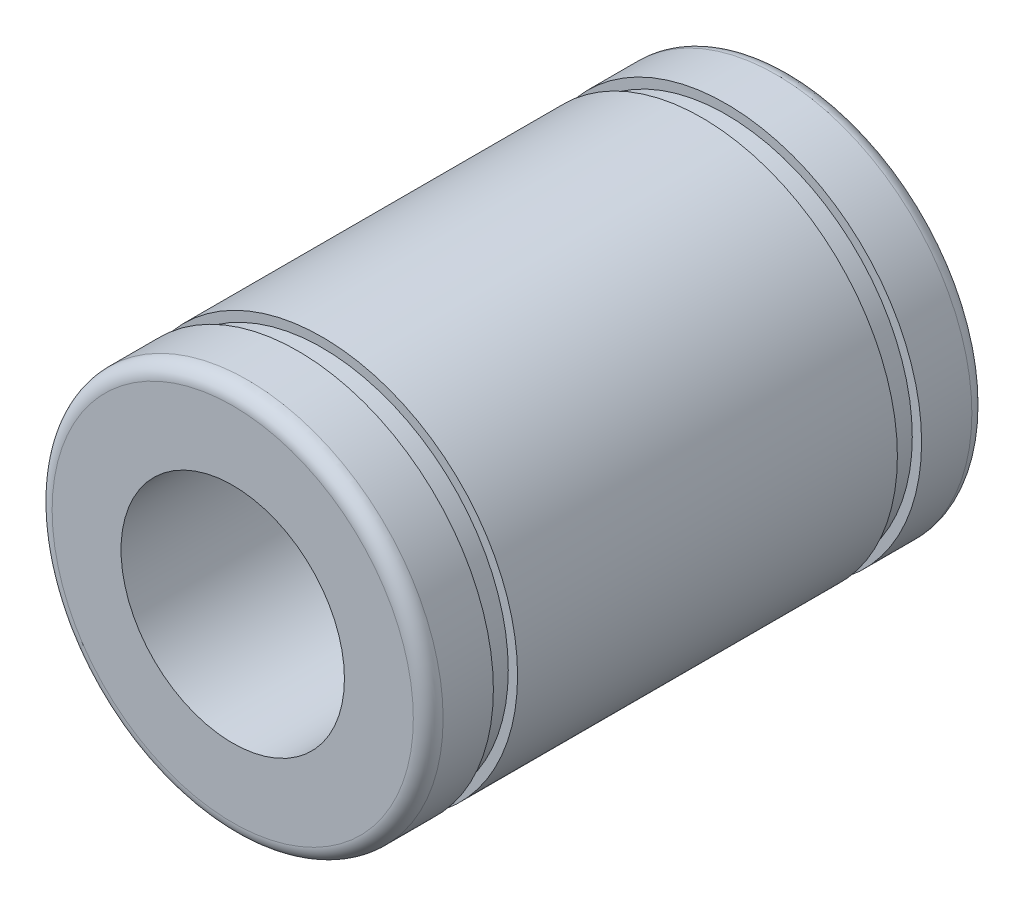
ISO-10303-21;
HEADER;
FILE_DESCRIPTION(('STEP AP214'),'2;1');
FILE_NAME('part.step','',(''),(''),'','','');
FILE_SCHEMA(('AUTOMOTIVE_DESIGN { 1 0 10303 214 1 1 1 1 }'));
ENDSEC;
DATA;
#1=APPLICATION_CONTEXT('core data for automotive mechanical design processes');
#2=APPLICATION_PROTOCOL_DEFINITION('international standard','automotive_design',2000,#1);
#3=PRODUCT_CONTEXT('',#1,'mechanical');
#4=PRODUCT('Part','Part','',(#3));
#5=PRODUCT_RELATED_PRODUCT_CATEGORY('part','',(#4));
#6=PRODUCT_DEFINITION_FORMATION('','',#4);
#7=PRODUCT_DEFINITION_CONTEXT('part definition',#1,'design');
#8=PRODUCT_DEFINITION('design','',#6,#7);
#9=PRODUCT_DEFINITION_SHAPE('','',#8);
#10=(LENGTH_UNIT() NAMED_UNIT(*) SI_UNIT(.MILLI.,.METRE.));
#11=(NAMED_UNIT(*) PLANE_ANGLE_UNIT() SI_UNIT($,.RADIAN.));
#12=(NAMED_UNIT(*) SI_UNIT($,.STERADIAN.) SOLID_ANGLE_UNIT());
#13=UNCERTAINTY_MEASURE_WITH_UNIT(LENGTH_MEASURE(1.E-05),#10,'distance_accuracy_value','');
#14=(GEOMETRIC_REPRESENTATION_CONTEXT(3) GLOBAL_UNCERTAINTY_ASSIGNED_CONTEXT((#13)) GLOBAL_UNIT_ASSIGNED_CONTEXT((#10,
#11,#12)) REPRESENTATION_CONTEXT('',''));
#15=CARTESIAN_POINT('',(0.,0.,0.));
#16=DIRECTION('',(0.,0.,1.));
#17=DIRECTION('',(1.,0.,0.));
#18=AXIS2_PLACEMENT_3D('',#15,#16,#17);
#19=CARTESIAN_POINT('',(0.,0.,-16.85));
#20=DIRECTION('',(0.,0.,1.));
#21=DIRECTION('',(1.,0.,0.));
#22=AXIS2_PLACEMENT_3D('',#19,#20,#21);
#23=CYLINDRICAL_SURFACE('',#22,6.);
#24=CARTESIAN_POINT('',(0.,0.,-1.85));
#25=DIRECTION('',(0.,0.,1.));
#26=DIRECTION('',(1.,0.,0.));
#27=AXIS2_PLACEMENT_3D('',#24,#25,#26);
#28=CIRCLE('',#27,6.);
#29=CARTESIAN_POINT('',(6.,0.,-1.85));
#30=VERTEX_POINT('',#29);
#31=EDGE_CURVE('E177',#30,#30,#28,.F.);
#32=ORIENTED_EDGE('',*,*,#31,.F.);
#33=EDGE_LOOP('',(#32));
#34=FACE_BOUND('',#33,.T.);
#35=CARTESIAN_POINT('',(0.,0.,-31.85));
#36=DIRECTION('',(0.,0.,1.));
#37=DIRECTION('',(1.,0.,0.));
#38=AXIS2_PLACEMENT_3D('',#35,#36,#37);
#39=CIRCLE('',#38,6.);
#40=CARTESIAN_POINT('',(6.,0.,-31.85));
#41=VERTEX_POINT('',#40);
#42=EDGE_CURVE('E62',#41,#41,#39,.T.);
#43=ORIENTED_EDGE('',*,*,#42,.F.);
#44=EDGE_LOOP('',(#43));
#45=FACE_BOUND('',#44,.T.);
#46=ADVANCED_FACE('F16',(#34,#45),#23,.F.);
#47=CARTESIAN_POINT('',(0.,7.85,-1.85));
#48=DIRECTION('',(0.,0.,1.));
#49=DIRECTION('',(1.,0.,0.));
#50=AXIS2_PLACEMENT_3D('',#47,#48,#49);
#51=PLANE('',#50);
#52=ORIENTED_EDGE('',*,*,#31,.T.);
#53=EDGE_LOOP('',(#52));
#54=FACE_BOUND('',#53,.T.);
#55=CARTESIAN_POINT('',(0.,0.,-1.85000000000001));
#56=DIRECTION('',(0.,0.,-1.));
#57=DIRECTION('',(-1.,0.,0.));
#58=AXIS2_PLACEMENT_3D('',#55,#56,#57);
#59=CIRCLE('',#58,9.7);
#60=CARTESIAN_POINT('',(-9.7,0.,-1.85));
#61=VERTEX_POINT('',#60);
#62=CARTESIAN_POINT('',(0.,9.7,-1.85));
#63=VERTEX_POINT('',#62);
#64=EDGE_CURVE('E56',#61,#63,#59,.T.);
#65=ORIENTED_EDGE('',*,*,#64,.F.);
#66=CARTESIAN_POINT('',(0.,0.,-1.85000000000001));
#67=DIRECTION('',(0.,0.,-1.));
#68=DIRECTION('',(1.,0.,0.));
#69=AXIS2_PLACEMENT_3D('',#66,#67,#68);
#70=CIRCLE('',#69,9.7);
#71=CARTESIAN_POINT('',(9.7,0.,-1.85));
#72=VERTEX_POINT('',#71);
#73=EDGE_CURVE('E52',#72,#61,#70,.T.);
#74=ORIENTED_EDGE('',*,*,#73,.F.);
#75=CARTESIAN_POINT('',(0.,0.,-1.85000000000001));
#76=DIRECTION('',(0.,0.,-1.));
#77=DIRECTION('',(0.,1.,0.));
#78=AXIS2_PLACEMENT_3D('',#75,#76,#77);
#79=CIRCLE('',#78,9.7);
#80=EDGE_CURVE('E58',#63,#72,#79,.T.);
#81=ORIENTED_EDGE('',*,*,#80,.F.);
#82=EDGE_LOOP('',(#65,#74,#81));
#83=FACE_BOUND('',#82,.T.);
#84=ADVANCED_FACE('F65',(#54,#83),#51,.T.);
#85=CARTESIAN_POINT('',(0.,7.85,-31.85));
#86=DIRECTION('',(0.,0.,-1.));
#87=DIRECTION('',(-1.,0.,0.));
#88=AXIS2_PLACEMENT_3D('',#85,#86,#87);
#89=PLANE('',#88);
#90=CARTESIAN_POINT('',(0.,0.,-31.85));
#91=DIRECTION('',(0.,0.,1.));
#92=DIRECTION('',(-1.,0.,0.));
#93=AXIS2_PLACEMENT_3D('',#90,#91,#92);
#94=CIRCLE('',#93,9.7);
#95=CARTESIAN_POINT('',(-9.7,0.,-31.85));
#96=VERTEX_POINT('',#95);
#97=CARTESIAN_POINT('',(9.7,0.,-31.85));
#98=VERTEX_POINT('',#97);
#99=EDGE_CURVE('E120',#96,#98,#94,.T.);
#100=ORIENTED_EDGE('',*,*,#99,.F.);
#101=CARTESIAN_POINT('',(0.,0.,-31.85));
#102=DIRECTION('',(0.,0.,1.));
#103=DIRECTION('',(0.,1.,0.));
#104=AXIS2_PLACEMENT_3D('',#101,#102,#103);
#105=CIRCLE('',#104,9.7);
#106=CARTESIAN_POINT('',(0.,9.7,-31.85));
#107=VERTEX_POINT('',#106);
#108=EDGE_CURVE('E140',#107,#96,#105,.T.);
#109=ORIENTED_EDGE('',*,*,#108,.F.);
#110=CARTESIAN_POINT('',(0.,0.,-31.85));
#111=DIRECTION('',(0.,0.,1.));
#112=DIRECTION('',(1.,0.,0.));
#113=AXIS2_PLACEMENT_3D('',#110,#111,#112);
#114=CIRCLE('',#113,9.7);
#115=EDGE_CURVE('E36',#98,#107,#114,.T.);
#116=ORIENTED_EDGE('',*,*,#115,.F.);
#117=EDGE_LOOP('',(#100,#109,#116));
#118=FACE_BOUND('',#117,.T.);
#119=ORIENTED_EDGE('',*,*,#42,.T.);
#120=EDGE_LOOP('',(#119));
#121=FACE_BOUND('',#120,.T.);
#122=ADVANCED_FACE('F82',(#118,#121),#89,.T.);
#123=CARTESIAN_POINT('',(0.,0.,-2.65000000000001));
#124=DIRECTION('',(0.,0.,-1.));
#125=DIRECTION('',(-1.,0.,0.));
#126=AXIS2_PLACEMENT_3D('',#123,#124,#125);
#127=TOROIDAL_SURFACE('',#126,9.7,0.800000000000004);
#128=ORIENTED_EDGE('',*,*,#73,.T.);
#129=ORIENTED_EDGE('',*,*,#64,.T.);
#130=ORIENTED_EDGE('',*,*,#80,.T.);
#131=EDGE_LOOP('',(#128,#129,#130));
#132=FACE_BOUND('',#131,.T.);
#133=CARTESIAN_POINT('',(0.,0.,-2.65));
#134=DIRECTION('',(0.,0.,1.));
#135=DIRECTION('',(1.,0.,0.));
#136=AXIS2_PLACEMENT_3D('',#133,#134,#135);
#137=CIRCLE('',#136,10.5);
#138=CARTESIAN_POINT('',(10.5,0.,-2.65));
#139=VERTEX_POINT('',#138);
#140=EDGE_CURVE('E117',#139,#139,#137,.F.);
#141=ORIENTED_EDGE('',*,*,#140,.F.);
#142=EDGE_LOOP('',(#141));
#143=FACE_BOUND('',#142,.T.);
#144=ADVANCED_FACE('F54',(#132,#143),#127,.T.);
#145=CARTESIAN_POINT('',(0.,0.,-31.05));
#146=DIRECTION('',(0.,0.,-1.));
#147=DIRECTION('',(-1.,0.,0.));
#148=AXIS2_PLACEMENT_3D('',#145,#146,#147);
#149=TOROIDAL_SURFACE('',#148,9.7,0.799999999999999);
#150=ORIENTED_EDGE('',*,*,#108,.T.);
#151=ORIENTED_EDGE('',*,*,#99,.T.);
#152=ORIENTED_EDGE('',*,*,#115,.T.);
#153=EDGE_LOOP('',(#150,#151,#152));
#154=FACE_BOUND('',#153,.T.);
#155=CARTESIAN_POINT('',(0.,0.,-31.05));
#156=DIRECTION('',(0.,0.,1.));
#157=DIRECTION('',(1.,0.,0.));
#158=AXIS2_PLACEMENT_3D('',#155,#156,#157);
#159=CIRCLE('',#158,10.5);
#160=CARTESIAN_POINT('',(10.5,0.,-31.05));
#161=VERTEX_POINT('',#160);
#162=EDGE_CURVE('E119',#161,#161,#159,.T.);
#163=ORIENTED_EDGE('',*,*,#162,.F.);
#164=EDGE_LOOP('',(#163));
#165=FACE_BOUND('',#164,.T.);
#166=ADVANCED_FACE('F107',(#154,#165),#149,.T.);
#167=CARTESIAN_POINT('',(0.,0.,-4.));
#168=DIRECTION('',(0.,0.,1.));
#169=DIRECTION('',(1.,0.,0.));
#170=AXIS2_PLACEMENT_3D('',#167,#168,#169);
#171=CYLINDRICAL_SURFACE('',#170,10.5);
#172=CARTESIAN_POINT('',(0.,0.,-5.35));
#173=DIRECTION('',(0.,0.,1.));
#174=DIRECTION('',(1.,0.,0.));
#175=AXIS2_PLACEMENT_3D('',#172,#173,#174);
#176=CIRCLE('',#175,10.5);
#177=CARTESIAN_POINT('',(10.5,0.,-5.35));
#178=VERTEX_POINT('',#177);
#179=EDGE_CURVE('E182',#178,#178,#176,.F.);
#180=ORIENTED_EDGE('',*,*,#179,.F.);
#181=EDGE_LOOP('',(#180));
#182=FACE_BOUND('',#181,.T.);
#183=ORIENTED_EDGE('',*,*,#140,.T.);
#184=EDGE_LOOP('',(#183));
#185=FACE_BOUND('',#184,.T.);
#186=ADVANCED_FACE('F291',(#182,#185),#171,.T.);
#187=CARTESIAN_POINT('',(0.,0.,-29.7));
#188=DIRECTION('',(0.,0.,1.));
#189=DIRECTION('',(1.,0.,0.));
#190=AXIS2_PLACEMENT_3D('',#187,#188,#189);
#191=CYLINDRICAL_SURFACE('',#190,10.5);
#192=ORIENTED_EDGE('',*,*,#162,.T.);
#193=EDGE_LOOP('',(#192));
#194=FACE_BOUND('',#193,.T.);
#195=CARTESIAN_POINT('',(0.,0.,-28.35));
#196=DIRECTION('',(0.,0.,1.));
#197=DIRECTION('',(1.,0.,0.));
#198=AXIS2_PLACEMENT_3D('',#195,#196,#197);
#199=CIRCLE('',#198,10.5);
#200=CARTESIAN_POINT('',(10.5,0.,-28.35));
#201=VERTEX_POINT('',#200);
#202=EDGE_CURVE('E185',#201,#201,#199,.T.);
#203=ORIENTED_EDGE('',*,*,#202,.F.);
#204=EDGE_LOOP('',(#203));
#205=FACE_BOUND('',#204,.T.);
#206=ADVANCED_FACE('F281',(#194,#205),#191,.T.);
#207=CARTESIAN_POINT('',(0.,10.25,-5.35));
#208=DIRECTION('',(0.,0.,-1.));
#209=DIRECTION('',(-1.,0.,0.));
#210=AXIS2_PLACEMENT_3D('',#207,#208,#209);
#211=PLANE('',#210);
#212=ORIENTED_EDGE('',*,*,#179,.T.);
#213=EDGE_LOOP('',(#212));
#214=FACE_BOUND('',#213,.T.);
#215=CARTESIAN_POINT('',(0.,0.,-5.35));
#216=DIRECTION('',(0.,0.,1.));
#217=DIRECTION('',(1.,0.,0.));
#218=AXIS2_PLACEMENT_3D('',#215,#216,#217);
#219=CIRCLE('',#218,10.);
#220=CARTESIAN_POINT('',(10.,0.,-5.35));
#221=VERTEX_POINT('',#220);
#222=EDGE_CURVE('E188',#221,#221,#219,.F.);
#223=ORIENTED_EDGE('',*,*,#222,.F.);
#224=EDGE_LOOP('',(#223));
#225=FACE_BOUND('',#224,.T.);
#226=ADVANCED_FACE('F271',(#214,#225),#211,.T.);
#227=CARTESIAN_POINT('',(0.,10.25,-28.35));
#228=DIRECTION('',(0.,0.,1.));
#229=DIRECTION('',(0.,-1.,0.));
#230=AXIS2_PLACEMENT_3D('',#227,#228,#229);
#231=PLANE('',#230);
#232=CARTESIAN_POINT('',(0.,0.,-28.35));
#233=DIRECTION('',(0.,0.,1.));
#234=DIRECTION('',(1.,0.,0.));
#235=AXIS2_PLACEMENT_3D('',#232,#233,#234);
#236=CIRCLE('',#235,10.);
#237=CARTESIAN_POINT('',(10.,0.,-28.35));
#238=VERTEX_POINT('',#237);
#239=EDGE_CURVE('E191',#238,#238,#236,.T.);
#240=ORIENTED_EDGE('',*,*,#239,.F.);
#241=EDGE_LOOP('',(#240));
#242=FACE_BOUND('',#241,.T.);
#243=ORIENTED_EDGE('',*,*,#202,.T.);
#244=EDGE_LOOP('',(#243));
#245=FACE_BOUND('',#244,.T.);
#246=ADVANCED_FACE('F261',(#242,#245),#231,.T.);
#247=CARTESIAN_POINT('',(0.,0.,-6.));
#248=DIRECTION('',(0.,0.,1.));
#249=DIRECTION('',(1.,0.,0.));
#250=AXIS2_PLACEMENT_3D('',#247,#248,#249);
#251=CYLINDRICAL_SURFACE('',#250,10.);
#252=CARTESIAN_POINT('',(0.,0.,-6.65));
#253=DIRECTION('',(0.,0.,1.));
#254=DIRECTION('',(1.,0.,0.));
#255=AXIS2_PLACEMENT_3D('',#252,#253,#254);
#256=CIRCLE('',#255,10.);
#257=CARTESIAN_POINT('',(10.,0.,-6.65));
#258=VERTEX_POINT('',#257);
#259=EDGE_CURVE('E194',#258,#258,#256,.F.);
#260=ORIENTED_EDGE('',*,*,#259,.F.);
#261=EDGE_LOOP('',(#260));
#262=FACE_BOUND('',#261,.T.);
#263=ORIENTED_EDGE('',*,*,#222,.T.);
#264=EDGE_LOOP('',(#263));
#265=FACE_BOUND('',#264,.T.);
#266=ADVANCED_FACE('F226',(#262,#265),#251,.T.);
#267=CARTESIAN_POINT('',(0.,0.,-27.7));
#268=DIRECTION('',(0.,0.,1.));
#269=DIRECTION('',(1.,0.,0.));
#270=AXIS2_PLACEMENT_3D('',#267,#268,#269);
#271=CYLINDRICAL_SURFACE('',#270,10.);
#272=ORIENTED_EDGE('',*,*,#239,.T.);
#273=EDGE_LOOP('',(#272));
#274=FACE_BOUND('',#273,.T.);
#275=CARTESIAN_POINT('',(0.,0.,-27.05));
#276=DIRECTION('',(0.,0.,1.));
#277=DIRECTION('',(1.,0.,0.));
#278=AXIS2_PLACEMENT_3D('',#275,#276,#277);
#279=CIRCLE('',#278,10.);
#280=CARTESIAN_POINT('',(10.,0.,-27.05));
#281=VERTEX_POINT('',#280);
#282=EDGE_CURVE('E197',#281,#281,#279,.T.);
#283=ORIENTED_EDGE('',*,*,#282,.F.);
#284=EDGE_LOOP('',(#283));
#285=FACE_BOUND('',#284,.T.);
#286=ADVANCED_FACE('F216',(#274,#285),#271,.T.);
#287=CARTESIAN_POINT('',(0.,10.25,-6.65));
#288=DIRECTION('',(0.,0.,1.));
#289=DIRECTION('',(1.,0.,0.));
#290=AXIS2_PLACEMENT_3D('',#287,#288,#289);
#291=PLANE('',#290);
#292=ORIENTED_EDGE('',*,*,#259,.T.);
#293=EDGE_LOOP('',(#292));
#294=FACE_BOUND('',#293,.T.);
#295=CARTESIAN_POINT('',(0.,0.,-6.65));
#296=DIRECTION('',(0.,0.,1.));
#297=DIRECTION('',(1.,0.,0.));
#298=AXIS2_PLACEMENT_3D('',#295,#296,#297);
#299=CIRCLE('',#298,10.5);
#300=CARTESIAN_POINT('',(10.5,0.,-6.65));
#301=VERTEX_POINT('',#300);
#302=EDGE_CURVE('E27',#301,#301,#299,.F.);
#303=ORIENTED_EDGE('',*,*,#302,.F.);
#304=EDGE_LOOP('',(#303));
#305=FACE_BOUND('',#304,.T.);
#306=ADVANCED_FACE('F213',(#294,#305),#291,.T.);
#307=CARTESIAN_POINT('',(0.,10.25,-27.05));
#308=DIRECTION('',(0.,0.,-1.));
#309=DIRECTION('',(-1.,0.,0.));
#310=AXIS2_PLACEMENT_3D('',#307,#308,#309);
#311=PLANE('',#310);
#312=CARTESIAN_POINT('',(0.,0.,-27.05));
#313=DIRECTION('',(0.,0.,1.));
#314=DIRECTION('',(1.,0.,0.));
#315=AXIS2_PLACEMENT_3D('',#312,#313,#314);
#316=CIRCLE('',#315,10.5);
#317=CARTESIAN_POINT('',(10.5,0.,-27.05));
#318=VERTEX_POINT('',#317);
#319=EDGE_CURVE('E11',#318,#318,#316,.T.);
#320=ORIENTED_EDGE('',*,*,#319,.F.);
#321=EDGE_LOOP('',(#320));
#322=FACE_BOUND('',#321,.T.);
#323=ORIENTED_EDGE('',*,*,#282,.T.);
#324=EDGE_LOOP('',(#323));
#325=FACE_BOUND('',#324,.T.);
#326=ADVANCED_FACE('F215',(#322,#325),#311,.T.);
#327=CARTESIAN_POINT('',(0.,0.,-16.85));
#328=DIRECTION('',(0.,0.,1.));
#329=DIRECTION('',(1.,0.,0.));
#330=AXIS2_PLACEMENT_3D('',#327,#328,#329);
#331=CYLINDRICAL_SURFACE('',#330,10.5);
#332=ORIENTED_EDGE('',*,*,#302,.T.);
#333=EDGE_LOOP('',(#332));
#334=FACE_BOUND('',#333,.T.);
#335=ORIENTED_EDGE('',*,*,#319,.T.);
#336=EDGE_LOOP('',(#335));
#337=FACE_BOUND('',#336,.T.);
#338=ADVANCED_FACE('F210',(#334,#337),#331,.T.);
#339=CLOSED_SHELL('',(#46,#84,#122,#144,#166,#186,#206,#226,#246,#266,#286,#306,#326,#338));
#340=MANIFOLD_SOLID_BREP('B1',#339);
#341=ADVANCED_BREP_SHAPE_REPRESENTATION('',(#18,#340),#14);
#342=SHAPE_DEFINITION_REPRESENTATION(#9,#341);
ENDSEC;
END-ISO-10303-21;
